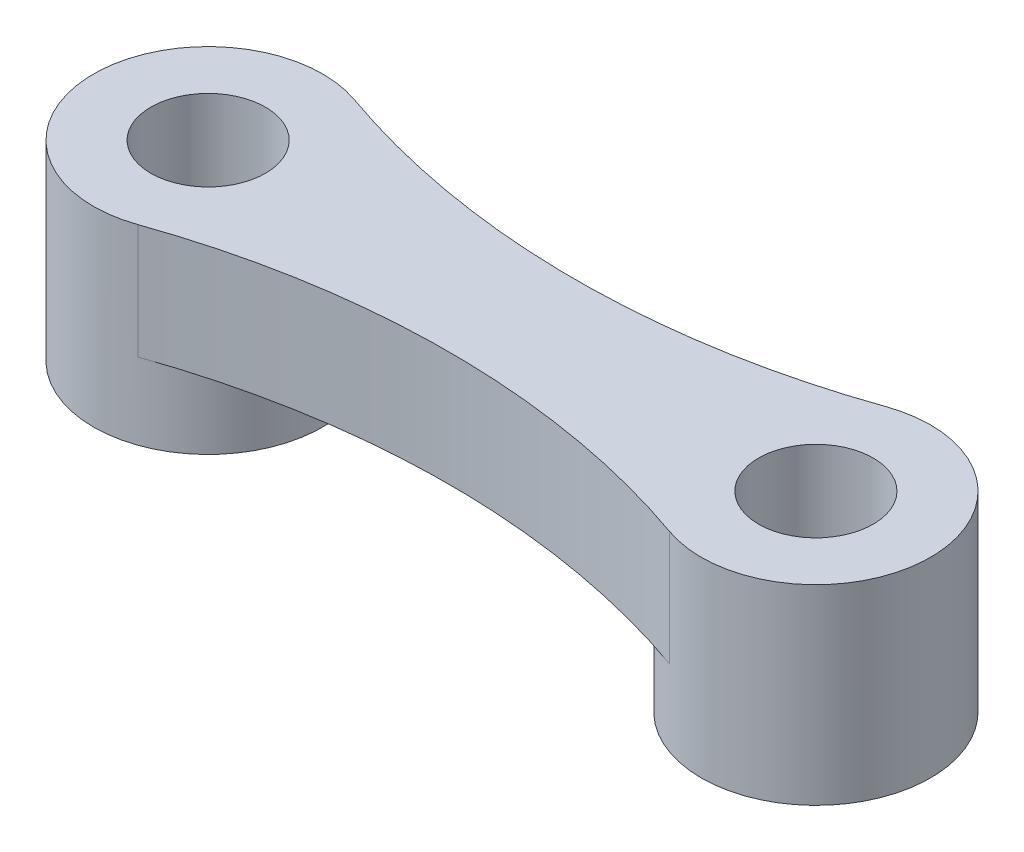
ISO-10303-21;
HEADER;
FILE_DESCRIPTION(('STEP AP214'),'2;1');
FILE_NAME('part.step','',(''),(''),'','','');
FILE_SCHEMA(('AUTOMOTIVE_DESIGN { 1 0 10303 214 1 1 1 1 }'));
ENDSEC;
DATA;
#1=APPLICATION_CONTEXT('core data for automotive mechanical design processes');
#2=APPLICATION_PROTOCOL_DEFINITION('international standard','automotive_design',2000,#1);
#3=PRODUCT_CONTEXT('',#1,'mechanical');
#4=PRODUCT('Part','Part','',(#3));
#5=PRODUCT_RELATED_PRODUCT_CATEGORY('part','',(#4));
#6=PRODUCT_DEFINITION_FORMATION('','',#4);
#7=PRODUCT_DEFINITION_CONTEXT('part definition',#1,'design');
#8=PRODUCT_DEFINITION('design','',#6,#7);
#9=PRODUCT_DEFINITION_SHAPE('','',#8);
#10=(LENGTH_UNIT() NAMED_UNIT(*) SI_UNIT(.MILLI.,.METRE.));
#11=(NAMED_UNIT(*) PLANE_ANGLE_UNIT() SI_UNIT($,.RADIAN.));
#12=(NAMED_UNIT(*) SI_UNIT($,.STERADIAN.) SOLID_ANGLE_UNIT());
#13=UNCERTAINTY_MEASURE_WITH_UNIT(LENGTH_MEASURE(1.E-05),#10,'distance_accuracy_value','');
#14=(GEOMETRIC_REPRESENTATION_CONTEXT(3) GLOBAL_UNCERTAINTY_ASSIGNED_CONTEXT((#13)) GLOBAL_UNIT_ASSIGNED_CONTEXT((#10,
#11,#12)) REPRESENTATION_CONTEXT('',''));
#15=CARTESIAN_POINT('',(0.,0.,0.));
#16=DIRECTION('',(0.,0.,1.));
#17=DIRECTION('',(1.,0.,0.));
#18=AXIS2_PLACEMENT_3D('',#15,#16,#17);
#19=CARTESIAN_POINT('',(-7.95,3.,0.));
#20=DIRECTION('',(0.,1.,0.));
#21=DIRECTION('',(0.,0.,1.));
#22=AXIS2_PLACEMENT_3D('',#19,#20,#21);
#23=PLANE('',#22);
#24=CARTESIAN_POINT('',(-7.95,3.,0.));
#25=DIRECTION('',(0.,1.,0.));
#26=DIRECTION('',(0.,0.,1.));
#27=AXIS2_PLACEMENT_3D('',#24,#25,#26);
#28=CIRCLE('',#27,1.5);
#29=CARTESIAN_POINT('',(-7.95,3.,1.5));
#30=VERTEX_POINT('',#29);
#31=EDGE_CURVE('E151',#30,#30,#28,.T.);
#32=ORIENTED_EDGE('',*,*,#31,.F.);
#33=EDGE_LOOP('',(#32));
#34=FACE_BOUND('',#33,.T.);
#35=CARTESIAN_POINT('',(7.95,3.,0.));
#36=DIRECTION('',(0.,1.,0.));
#37=DIRECTION('',(0.,0.,1.));
#38=AXIS2_PLACEMENT_3D('',#35,#36,#37);
#39=CIRCLE('',#38,1.5);
#40=CARTESIAN_POINT('',(7.95,3.,1.5));
#41=VERTEX_POINT('',#40);
#42=EDGE_CURVE('E146',#41,#41,#39,.T.);
#43=ORIENTED_EDGE('',*,*,#42,.F.);
#44=EDGE_LOOP('',(#43));
#45=FACE_BOUND('',#44,.T.);
#46=CARTESIAN_POINT('',(7.95,3.,0.));
#47=DIRECTION('',(0.,1.,0.));
#48=DIRECTION('',(0.,0.,1.));
#49=AXIS2_PLACEMENT_3D('',#46,#47,#48);
#50=CIRCLE('',#49,3.);
#51=CARTESIAN_POINT('',(6.95625,3.,2.83062907098404));
#52=VERTEX_POINT('',#51);
#53=CARTESIAN_POINT('',(6.95625000000001,3.,-2.83062907098404));
#54=VERTEX_POINT('',#53);
#55=EDGE_CURVE('E13',#52,#54,#50,.T.);
#56=ORIENTED_EDGE('',*,*,#55,.T.);
#57=CARTESIAN_POINT('',(0.,3.,-22.6450325678724));
#58=DIRECTION('',(0.,-1.,0.));
#59=DIRECTION('',(0.,0.,1.));
#60=AXIS2_PLACEMENT_3D('',#57,#58,#59);
#61=CIRCLE('',#60,21.);
#62=CARTESIAN_POINT('',(-6.95625,3.,-2.83062907098405));
#63=VERTEX_POINT('',#62);
#64=EDGE_CURVE('E141',#54,#63,#61,.T.);
#65=ORIENTED_EDGE('',*,*,#64,.T.);
#66=CARTESIAN_POINT('',(-7.95,3.,0.));
#67=DIRECTION('',(0.,1.,0.));
#68=DIRECTION('',(0.,0.,1.));
#69=AXIS2_PLACEMENT_3D('',#66,#67,#68);
#70=CIRCLE('',#69,3.);
#71=CARTESIAN_POINT('',(-6.95625,3.,2.83062907098405));
#72=VERTEX_POINT('',#71);
#73=EDGE_CURVE('E80',#63,#72,#70,.T.);
#74=ORIENTED_EDGE('',*,*,#73,.T.);
#75=CARTESIAN_POINT('',(0.,3.,22.6450325678724));
#76=DIRECTION('',(0.,-1.,0.));
#77=DIRECTION('',(0.,0.,-1.));
#78=AXIS2_PLACEMENT_3D('',#75,#76,#77);
#79=CIRCLE('',#78,21.);
#80=EDGE_CURVE('E137',#72,#52,#79,.T.);
#81=ORIENTED_EDGE('',*,*,#80,.T.);
#82=EDGE_LOOP('',(#56,#65,#74,#81));
#83=FACE_BOUND('',#82,.T.);
#84=ADVANCED_FACE('F72',(#34,#45,#83),#23,.T.);
#85=CARTESIAN_POINT('',(-7.95,0.,0.));
#86=DIRECTION('',(0.,1.,0.));
#87=DIRECTION('',(0.,0.,1.));
#88=AXIS2_PLACEMENT_3D('',#85,#86,#87);
#89=PLANE('',#88);
#90=CARTESIAN_POINT('',(0.,0.,-22.6450325678724));
#91=DIRECTION('',(0.,-1.,0.));
#92=DIRECTION('',(0.,0.,1.));
#93=AXIS2_PLACEMENT_3D('',#90,#91,#92);
#94=CIRCLE('',#93,21.);
#95=CARTESIAN_POINT('',(6.95625000000001,0.,-2.83062907098404));
#96=VERTEX_POINT('',#95);
#97=CARTESIAN_POINT('',(-6.95625,0.,-2.83062907098405));
#98=VERTEX_POINT('',#97);
#99=EDGE_CURVE('E116',#96,#98,#94,.T.);
#100=ORIENTED_EDGE('',*,*,#99,.F.);
#101=CARTESIAN_POINT('',(7.95,0.,0.));
#102=DIRECTION('',(0.,1.,0.));
#103=DIRECTION('',(0.,0.,1.));
#104=AXIS2_PLACEMENT_3D('',#101,#102,#103);
#105=CIRCLE('',#104,3.);
#106=CARTESIAN_POINT('',(6.95625,0.,2.83062907098405));
#107=VERTEX_POINT('',#106);
#108=EDGE_CURVE('E110',#96,#107,#105,.T.);
#109=ORIENTED_EDGE('',*,*,#108,.T.);
#110=CARTESIAN_POINT('',(0.,0.,22.6450325678724));
#111=DIRECTION('',(0.,-1.,0.));
#112=DIRECTION('',(0.,0.,-1.));
#113=AXIS2_PLACEMENT_3D('',#110,#111,#112);
#114=CIRCLE('',#113,21.);
#115=CARTESIAN_POINT('',(-6.95625,0.,2.83062907098405));
#116=VERTEX_POINT('',#115);
#117=EDGE_CURVE('E114',#116,#107,#114,.T.);
#118=ORIENTED_EDGE('',*,*,#117,.F.);
#119=CARTESIAN_POINT('',(-7.95,0.,0.));
#120=DIRECTION('',(0.,1.,0.));
#121=DIRECTION('',(0.,0.,1.));
#122=AXIS2_PLACEMENT_3D('',#119,#120,#121);
#123=CIRCLE('',#122,3.);
#124=EDGE_CURVE('E87',#116,#98,#123,.T.);
#125=ORIENTED_EDGE('',*,*,#124,.T.);
#126=EDGE_LOOP('',(#100,#109,#118,#125));
#127=FACE_BOUND('',#126,.T.);
#128=ADVANCED_FACE('F112',(#127),#89,.F.);
#129=CARTESIAN_POINT('',(-7.95,3.,0.));
#130=DIRECTION('',(0.,-1.,0.));
#131=DIRECTION('',(0.,0.,-1.));
#132=AXIS2_PLACEMENT_3D('',#129,#130,#131);
#133=CYLINDRICAL_SURFACE('',#132,3.);
#134=DIRECTION('',(0.,1.,0.));
#135=VECTOR('',#134,1.);
#136=CARTESIAN_POINT('',(-6.95625,0.,-2.83062907098405));
#137=LINE('',#136,#135);
#138=EDGE_CURVE('E134',#98,#63,#137,.T.);
#139=ORIENTED_EDGE('',*,*,#138,.F.);
#140=ORIENTED_EDGE('',*,*,#124,.F.);
#141=DIRECTION('',(0.,1.,0.));
#142=VECTOR('',#141,1.);
#143=CARTESIAN_POINT('',(-6.95625,0.,2.83062907098405));
#144=LINE('',#143,#142);
#145=EDGE_CURVE('E131',#116,#72,#144,.T.);
#146=ORIENTED_EDGE('',*,*,#145,.T.);
#147=ORIENTED_EDGE('',*,*,#73,.F.);
#148=EDGE_LOOP('',(#139,#140,#146,#147));
#149=FACE_BOUND('',#148,.T.);
#150=CARTESIAN_POINT('',(-7.95,-2.,0.));
#151=DIRECTION('',(0.,1.,0.));
#152=DIRECTION('',(0.,0.,1.));
#153=AXIS2_PLACEMENT_3D('',#150,#151,#152);
#154=CIRCLE('',#153,3.);
#155=CARTESIAN_POINT('',(-7.95,-2.,3.));
#156=VERTEX_POINT('',#155);
#157=EDGE_CURVE('E144',#156,#156,#154,.T.);
#158=ORIENTED_EDGE('',*,*,#157,.T.);
#159=EDGE_LOOP('',(#158));
#160=FACE_BOUND('',#159,.T.);
#161=ADVANCED_FACE('F74',(#149,#160),#133,.T.);
#162=CARTESIAN_POINT('',(7.95,3.,0.));
#163=DIRECTION('',(0.,-1.,0.));
#164=DIRECTION('',(0.,0.,-1.));
#165=AXIS2_PLACEMENT_3D('',#162,#163,#164);
#166=CYLINDRICAL_SURFACE('',#165,3.);
#167=DIRECTION('',(0.,1.,0.));
#168=VECTOR('',#167,1.);
#169=CARTESIAN_POINT('',(6.95625,0.,2.83062907098404));
#170=LINE('',#169,#168);
#171=EDGE_CURVE('E124',#107,#52,#170,.T.);
#172=ORIENTED_EDGE('',*,*,#171,.F.);
#173=ORIENTED_EDGE('',*,*,#108,.F.);
#174=DIRECTION('',(0.,1.,0.));
#175=VECTOR('',#174,1.);
#176=CARTESIAN_POINT('',(6.95625000000001,0.,-2.83062907098404));
#177=LINE('',#176,#175);
#178=EDGE_CURVE('E130',#96,#54,#177,.T.);
#179=ORIENTED_EDGE('',*,*,#178,.T.);
#180=ORIENTED_EDGE('',*,*,#55,.F.);
#181=EDGE_LOOP('',(#172,#173,#179,#180));
#182=FACE_BOUND('',#181,.T.);
#183=CARTESIAN_POINT('',(7.95,-2.,0.));
#184=DIRECTION('',(0.,1.,0.));
#185=DIRECTION('',(0.,0.,1.));
#186=AXIS2_PLACEMENT_3D('',#183,#184,#185);
#187=CIRCLE('',#186,3.);
#188=CARTESIAN_POINT('',(7.95,-2.,3.));
#189=VERTEX_POINT('',#188);
#190=EDGE_CURVE('E120',#189,#189,#187,.T.);
#191=ORIENTED_EDGE('',*,*,#190,.T.);
#192=EDGE_LOOP('',(#191));
#193=FACE_BOUND('',#192,.T.);
#194=ADVANCED_FACE('F125',(#182,#193),#166,.T.);
#195=CARTESIAN_POINT('',(-7.95,3.,0.));
#196=DIRECTION('',(0.,-1.,0.));
#197=DIRECTION('',(0.,0.,-1.));
#198=AXIS2_PLACEMENT_3D('',#195,#196,#197);
#199=CYLINDRICAL_SURFACE('',#198,1.5);
#200=ORIENTED_EDGE('',*,*,#31,.T.);
#201=EDGE_LOOP('',(#200));
#202=FACE_BOUND('',#201,.T.);
#203=CARTESIAN_POINT('',(-7.95,-2.,0.));
#204=DIRECTION('',(0.,1.,0.));
#205=DIRECTION('',(0.,0.,1.));
#206=AXIS2_PLACEMENT_3D('',#203,#204,#205);
#207=CIRCLE('',#206,1.5);
#208=CARTESIAN_POINT('',(-7.95,-2.,1.5));
#209=VERTEX_POINT('',#208);
#210=EDGE_CURVE('E161',#209,#209,#207,.T.);
#211=ORIENTED_EDGE('',*,*,#210,.F.);
#212=EDGE_LOOP('',(#211));
#213=FACE_BOUND('',#212,.T.);
#214=ADVANCED_FACE('F176',(#202,#213),#199,.F.);
#215=CARTESIAN_POINT('',(7.95,3.,0.));
#216=DIRECTION('',(0.,-1.,0.));
#217=DIRECTION('',(0.,0.,-1.));
#218=AXIS2_PLACEMENT_3D('',#215,#216,#217);
#219=CYLINDRICAL_SURFACE('',#218,1.5);
#220=ORIENTED_EDGE('',*,*,#42,.T.);
#221=EDGE_LOOP('',(#220));
#222=FACE_BOUND('',#221,.T.);
#223=CARTESIAN_POINT('',(7.95,-2.,0.));
#224=DIRECTION('',(0.,1.,0.));
#225=DIRECTION('',(0.,0.,1.));
#226=AXIS2_PLACEMENT_3D('',#223,#224,#225);
#227=CIRCLE('',#226,1.5);
#228=CARTESIAN_POINT('',(7.95,-2.,1.5));
#229=VERTEX_POINT('',#228);
#230=EDGE_CURVE('E121',#229,#229,#227,.T.);
#231=ORIENTED_EDGE('',*,*,#230,.F.);
#232=EDGE_LOOP('',(#231));
#233=FACE_BOUND('',#232,.T.);
#234=ADVANCED_FACE('F173',(#222,#233),#219,.F.);
#235=CARTESIAN_POINT('',(0.,0.,-22.6450325678724));
#236=DIRECTION('',(0.,1.,0.));
#237=DIRECTION('',(0.,0.,1.));
#238=AXIS2_PLACEMENT_3D('',#235,#236,#237);
#239=CYLINDRICAL_SURFACE('',#238,21.);
#240=ORIENTED_EDGE('',*,*,#64,.F.);
#241=ORIENTED_EDGE('',*,*,#178,.F.);
#242=ORIENTED_EDGE('',*,*,#99,.T.);
#243=ORIENTED_EDGE('',*,*,#138,.T.);
#244=EDGE_LOOP('',(#240,#241,#242,#243));
#245=FACE_BOUND('',#244,.T.);
#246=ADVANCED_FACE('F175',(#245),#239,.F.);
#247=CARTESIAN_POINT('',(0.,0.,22.6450325678724));
#248=DIRECTION('',(0.,1.,0.));
#249=DIRECTION('',(0.,0.,1.));
#250=AXIS2_PLACEMENT_3D('',#247,#248,#249);
#251=CYLINDRICAL_SURFACE('',#250,21.);
#252=ORIENTED_EDGE('',*,*,#80,.F.);
#253=ORIENTED_EDGE('',*,*,#145,.F.);
#254=ORIENTED_EDGE('',*,*,#117,.T.);
#255=ORIENTED_EDGE('',*,*,#171,.T.);
#256=EDGE_LOOP('',(#252,#253,#254,#255));
#257=FACE_BOUND('',#256,.T.);
#258=ADVANCED_FACE('F133',(#257),#251,.F.);
#259=CARTESIAN_POINT('',(-7.95,-2.,0.));
#260=DIRECTION('',(0.,1.,0.));
#261=DIRECTION('',(0.,0.,1.));
#262=AXIS2_PLACEMENT_3D('',#259,#260,#261);
#263=PLANE('',#262);
#264=ORIENTED_EDGE('',*,*,#210,.T.);
#265=EDGE_LOOP('',(#264));
#266=FACE_BOUND('',#265,.T.);
#267=ORIENTED_EDGE('',*,*,#157,.F.);
#268=EDGE_LOOP('',(#267));
#269=FACE_BOUND('',#268,.T.);
#270=ADVANCED_FACE('F228',(#266,#269),#263,.F.);
#271=CARTESIAN_POINT('',(7.95,-2.,0.));
#272=DIRECTION('',(0.,1.,0.));
#273=DIRECTION('',(0.,0.,1.));
#274=AXIS2_PLACEMENT_3D('',#271,#272,#273);
#275=PLANE('',#274);
#276=ORIENTED_EDGE('',*,*,#230,.T.);
#277=EDGE_LOOP('',(#276));
#278=FACE_BOUND('',#277,.T.);
#279=ORIENTED_EDGE('',*,*,#190,.F.);
#280=EDGE_LOOP('',(#279));
#281=FACE_BOUND('',#280,.T.);
#282=ADVANCED_FACE('F170',(#278,#281),#275,.F.);
#283=CLOSED_SHELL('',(#84,#128,#161,#194,#214,#234,#246,#258,#270,#282));
#284=MANIFOLD_SOLID_BREP('B2',#283);
#285=ADVANCED_BREP_SHAPE_REPRESENTATION('',(#18,#284),#14);
#286=SHAPE_DEFINITION_REPRESENTATION(#9,#285);
ENDSEC;
END-ISO-10303-21;
